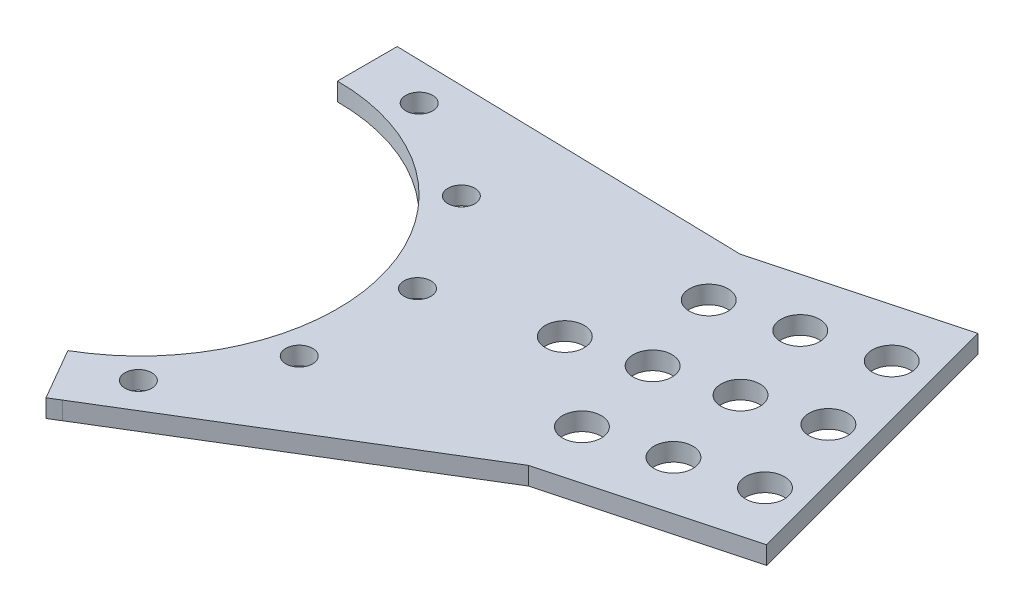
ISO-10303-21;
HEADER;
FILE_DESCRIPTION(('STEP AP214'),'2;1');
FILE_NAME('part.step','',(''),(''),'','','');
FILE_SCHEMA(('AUTOMOTIVE_DESIGN { 1 0 10303 214 1 1 1 1 }'));
ENDSEC;
DATA;
#1=APPLICATION_CONTEXT('core data for automotive mechanical design processes');
#2=APPLICATION_PROTOCOL_DEFINITION('international standard','automotive_design',2000,#1);
#3=PRODUCT_CONTEXT('',#1,'mechanical');
#4=PRODUCT('Part','Part','',(#3));
#5=PRODUCT_RELATED_PRODUCT_CATEGORY('part','',(#4));
#6=PRODUCT_DEFINITION_FORMATION('','',#4);
#7=PRODUCT_DEFINITION_CONTEXT('part definition',#1,'design');
#8=PRODUCT_DEFINITION('design','',#6,#7);
#9=PRODUCT_DEFINITION_SHAPE('','',#8);
#10=(LENGTH_UNIT() NAMED_UNIT(*) SI_UNIT(.MILLI.,.METRE.));
#11=(NAMED_UNIT(*) PLANE_ANGLE_UNIT() SI_UNIT($,.RADIAN.));
#12=(NAMED_UNIT(*) SI_UNIT($,.STERADIAN.) SOLID_ANGLE_UNIT());
#13=UNCERTAINTY_MEASURE_WITH_UNIT(LENGTH_MEASURE(1.E-05),#10,'distance_accuracy_value','');
#14=(GEOMETRIC_REPRESENTATION_CONTEXT(3) GLOBAL_UNCERTAINTY_ASSIGNED_CONTEXT((#13)) GLOBAL_UNIT_ASSIGNED_CONTEXT((#10,
#11,#12)) REPRESENTATION_CONTEXT('',''));
#15=CARTESIAN_POINT('',(0.,0.,0.));
#16=DIRECTION('',(0.,0.,1.));
#17=DIRECTION('',(1.,0.,0.));
#18=AXIS2_PLACEMENT_3D('',#15,#16,#17);
#19=CARTESIAN_POINT('',(56.0236979247659,-8.5,-15.0115046159464));
#20=DIRECTION('',(0.,1.,0.));
#21=DIRECTION('',(0.,0.,1.));
#22=AXIS2_PLACEMENT_3D('',#19,#20,#21);
#23=CYLINDRICAL_SURFACE('',#22,3.25000000000001);
#24=CARTESIAN_POINT('',(56.0236979247659,-1.5,-15.0115046159464));
#25=DIRECTION('',(0.,-1.,0.));
#26=DIRECTION('',(0.,0.,-1.));
#27=AXIS2_PLACEMENT_3D('',#24,#25,#26);
#28=CIRCLE('',#27,3.25000000000001);
#29=CARTESIAN_POINT('',(56.0236979247659,-1.5,-18.2615046159464));
#30=VERTEX_POINT('',#29);
#31=EDGE_CURVE('E39',#30,#30,#28,.T.);
#32=ORIENTED_EDGE('',*,*,#31,.T.);
#33=EDGE_LOOP('',(#32));
#34=FACE_BOUND('',#33,.T.);
#35=CARTESIAN_POINT('',(56.0236979247659,1.5,-15.0115046159464));
#36=DIRECTION('',(0.,1.,0.));
#37=DIRECTION('',(0.,0.,1.));
#38=AXIS2_PLACEMENT_3D('',#35,#36,#37);
#39=CIRCLE('',#38,3.25000000000001);
#40=CARTESIAN_POINT('',(56.0236979247659,1.5,-11.7615046159464));
#41=VERTEX_POINT('',#40);
#42=EDGE_CURVE('E11',#41,#41,#39,.T.);
#43=ORIENTED_EDGE('',*,*,#42,.T.);
#44=EDGE_LOOP('',(#43));
#45=FACE_BOUND('',#44,.T.);
#46=ADVANCED_FACE('F32',(#34,#45),#23,.F.);
#47=CARTESIAN_POINT('',(67.6148078402347,-8.5,-18.1173331571768));
#48=DIRECTION('',(0.,1.,0.));
#49=DIRECTION('',(0.,0.,1.));
#50=AXIS2_PLACEMENT_3D('',#47,#48,#49);
#51=CYLINDRICAL_SURFACE('',#50,3.25000000000001);
#52=CARTESIAN_POINT('',(67.6148078402347,-1.5,-18.1173331571768));
#53=DIRECTION('',(0.,-1.,0.));
#54=DIRECTION('',(0.,0.,-1.));
#55=AXIS2_PLACEMENT_3D('',#52,#53,#54);
#56=CIRCLE('',#55,3.25000000000001);
#57=CARTESIAN_POINT('',(67.6148078402347,-1.5,-21.3673331571768));
#58=VERTEX_POINT('',#57);
#59=EDGE_CURVE('E193',#58,#58,#56,.T.);
#60=ORIENTED_EDGE('',*,*,#59,.T.);
#61=EDGE_LOOP('',(#60));
#62=FACE_BOUND('',#61,.T.);
#63=CARTESIAN_POINT('',(67.6148078402347,1.5,-18.1173331571768));
#64=DIRECTION('',(0.,1.,0.));
#65=DIRECTION('',(0.,0.,1.));
#66=AXIS2_PLACEMENT_3D('',#63,#64,#65);
#67=CIRCLE('',#66,3.25000000000001);
#68=CARTESIAN_POINT('',(67.6148078402347,1.5,-14.8673331571768));
#69=VERTEX_POINT('',#68);
#70=EDGE_CURVE('E201',#69,#69,#67,.T.);
#71=ORIENTED_EDGE('',*,*,#70,.T.);
#72=EDGE_LOOP('',(#71));
#73=FACE_BOUND('',#72,.T.);
#74=ADVANCED_FACE('F228',(#62,#73),#51,.F.);
#75=CARTESIAN_POINT('',(0.,1.5,0.));
#76=DIRECTION('',(0.,-1.,0.));
#77=DIRECTION('',(0.,0.,-1.));
#78=AXIS2_PLACEMENT_3D('',#75,#76,#77);
#79=CYLINDRICAL_SURFACE('',#78,43.);
#80=DIRECTION('',(0.,-1.,0.));
#81=VECTOR('',#80,1.);
#82=CARTESIAN_POINT('',(23.2297705515371,1.5,36.1853252040511));
#83=LINE('',#82,#81);
#84=CARTESIAN_POINT('',(23.2297705515363,1.5,36.1853252040517));
#85=VERTEX_POINT('',#84);
#86=CARTESIAN_POINT('',(23.2297705515363,-1.5,36.1853252040517));
#87=VERTEX_POINT('',#86);
#88=EDGE_CURVE('E46',#85,#87,#83,.T.);
#89=ORIENTED_EDGE('',*,*,#88,.F.);
#90=CARTESIAN_POINT('',(0.,1.5,0.));
#91=DIRECTION('',(0.,1.,0.));
#92=DIRECTION('',(0.,0.,-1.));
#93=AXIS2_PLACEMENT_3D('',#90,#91,#92);
#94=CIRCLE('',#93,43.);
#95=CARTESIAN_POINT('',(21.4999999999998,1.5,37.239092362731));
#96=VERTEX_POINT('',#95);
#97=EDGE_CURVE('E166',#96,#85,#94,.T.);
#98=ORIENTED_EDGE('',*,*,#97,.F.);
#99=DIRECTION('',(0.,-1.,0.));
#100=VECTOR('',#99,1.);
#101=CARTESIAN_POINT('',(21.4999999999998,1.5,37.239092362731));
#102=LINE('',#101,#100);
#103=CARTESIAN_POINT('',(21.4999999999998,-1.5,37.239092362731));
#104=VERTEX_POINT('',#103);
#105=EDGE_CURVE('E175',#96,#104,#102,.T.);
#106=ORIENTED_EDGE('',*,*,#105,.T.);
#107=CARTESIAN_POINT('',(0.,-1.5,0.));
#108=DIRECTION('',(0.,1.,0.));
#109=DIRECTION('',(0.,0.,-1.));
#110=AXIS2_PLACEMENT_3D('',#107,#108,#109);
#111=CIRCLE('',#110,43.);
#112=EDGE_CURVE('E51',#104,#87,#111,.T.);
#113=ORIENTED_EDGE('',*,*,#112,.T.);
#114=EDGE_LOOP('',(#89,#98,#106,#113));
#115=FACE_BOUND('',#114,.T.);
#116=ADVANCED_FACE('F233',(#115),#79,.T.);
#117=CARTESIAN_POINT('',(103.06305875647,1.5,-1.73375885302606));
#118=DIRECTION('',(-0.258819045102531,0.,-0.965925826289066));
#119=DIRECTION('',(-0.965925826289066,0.,0.258819045102531));
#120=AXIS2_PLACEMENT_3D('',#117,#118,#119);
#121=PLANE('',#120);
#122=DIRECTION('',(0.,-1.,0.));
#123=VECTOR('',#122,1.);
#124=CARTESIAN_POINT('',(71.6635685232573,1.5,6.67970919771229));
#125=LINE('',#124,#123);
#126=CARTESIAN_POINT('',(71.6635685232573,1.5,6.67970919771258));
#127=VERTEX_POINT('',#126);
#128=CARTESIAN_POINT('',(71.6635685232573,-1.5,6.67970919771229));
#129=VERTEX_POINT('',#128);
#130=EDGE_CURVE('E123',#127,#129,#125,.T.);
#131=ORIENTED_EDGE('',*,*,#130,.T.);
#132=DIRECTION('',(0.965925826289065,0.,-0.258819045102531));
#133=VECTOR('',#132,1.);
#134=CARTESIAN_POINT('',(103.06305875647,-1.5,-1.73375885302606));
#135=LINE('',#134,#133);
#136=CARTESIAN_POINT('',(103.06305875647,-1.5,-1.73375885302606));
#137=VERTEX_POINT('',#136);
#138=EDGE_CURVE('E108',#129,#137,#135,.T.);
#139=ORIENTED_EDGE('',*,*,#138,.T.);
#140=DIRECTION('',(0.,-1.,0.));
#141=VECTOR('',#140,1.);
#142=CARTESIAN_POINT('',(103.06305875647,1.5,-1.73375885302606));
#143=LINE('',#142,#141);
#144=CARTESIAN_POINT('',(103.06305875647,1.5,-1.73375885302606));
#145=VERTEX_POINT('',#144);
#146=EDGE_CURVE('E158',#145,#137,#143,.T.);
#147=ORIENTED_EDGE('',*,*,#146,.F.);
#148=DIRECTION('',(0.965925826289065,0.,-0.258819045102531));
#149=VECTOR('',#148,1.);
#150=CARTESIAN_POINT('',(103.06305875647,1.5,-1.73375885302606));
#151=LINE('',#150,#149);
#152=EDGE_CURVE('E125',#127,#145,#151,.T.);
#153=ORIENTED_EDGE('',*,*,#152,.F.);
#154=EDGE_LOOP('',(#131,#139,#147,#153));
#155=FACE_BOUND('',#154,.T.);
#156=ADVANCED_FACE('F124',(#155),#121,.F.);
#157=DIRECTION('',(0.,-1.,0.));
#158=VECTOR('',#157,1.);
#159=CARTESIAN_POINT('',(2.02490881968836,1.5,-42.9522961466782));
#160=LINE('',#159,#158);
#161=CARTESIAN_POINT('',(2.02490881968772,-1.5,-42.9522961466782));
#162=VERTEX_POINT('',#161);
#163=CARTESIAN_POINT('',(2.02490881968772,1.5,-42.9522961466782));
#164=VERTEX_POINT('',#163);
#165=EDGE_CURVE('E149',#162,#164,#160,.F.);
#166=ORIENTED_EDGE('',*,*,#165,.F.);
#167=CARTESIAN_POINT('',(0.,-1.5,-43.));
#168=VERTEX_POINT('',#167);
#169=EDGE_CURVE('E165',#162,#168,#111,.T.);
#170=ORIENTED_EDGE('',*,*,#169,.T.);
#171=DIRECTION('',(0.,-1.,0.));
#172=VECTOR('',#171,1.);
#173=CARTESIAN_POINT('',(0.,1.5,-43.));
#174=LINE('',#173,#172);
#175=CARTESIAN_POINT('',(0.,1.5,-43.));
#176=VERTEX_POINT('',#175);
#177=EDGE_CURVE('E190',#176,#168,#174,.T.);
#178=ORIENTED_EDGE('',*,*,#177,.F.);
#179=EDGE_CURVE('E169',#164,#176,#94,.T.);
#180=ORIENTED_EDGE('',*,*,#179,.F.);
#181=EDGE_LOOP('',(#166,#170,#178,#180));
#182=FACE_BOUND('',#181,.T.);
#183=ADVANCED_FACE('F240',(#182),#79,.T.);
#184=CARTESIAN_POINT('',(90.1221065013434,1.5,-50.0300501674793));
#185=DIRECTION('',(0.258819045102531,0.,0.965925826289065));
#186=DIRECTION('',(0.965925826289066,0.,-0.258819045102531));
#187=AXIS2_PLACEMENT_3D('',#184,#185,#186);
#188=PLANE('',#187);
#189=DIRECTION('',(0.,-1.,0.));
#190=VECTOR('',#189,1.);
#191=CARTESIAN_POINT('',(58.722616268131,1.5,-41.6165821167408));
#192=LINE('',#191,#190);
#193=CARTESIAN_POINT('',(58.722616268131,1.5,-41.6165821167408));
#194=VERTEX_POINT('',#193);
#195=CARTESIAN_POINT('',(58.722616268131,-1.5,-41.6165821167408));
#196=VERTEX_POINT('',#195);
#197=EDGE_CURVE('E144',#194,#196,#192,.T.);
#198=ORIENTED_EDGE('',*,*,#197,.F.);
#199=DIRECTION('',(-0.965925826289066,0.,0.258819045102531));
#200=VECTOR('',#199,1.);
#201=CARTESIAN_POINT('',(90.1221065013434,1.5,-50.0300501674793));
#202=LINE('',#201,#200);
#203=CARTESIAN_POINT('',(90.1221065013434,1.5,-50.0300501674793));
#204=VERTEX_POINT('',#203);
#205=EDGE_CURVE('E154',#204,#194,#202,.T.);
#206=ORIENTED_EDGE('',*,*,#205,.F.);
#207=DIRECTION('',(0.,-1.,0.));
#208=VECTOR('',#207,1.);
#209=CARTESIAN_POINT('',(90.1221065013434,1.5,-50.0300501674793));
#210=LINE('',#209,#208);
#211=CARTESIAN_POINT('',(90.1221065013434,-1.5,-50.0300501674793));
#212=VERTEX_POINT('',#211);
#213=EDGE_CURVE('E162',#204,#212,#210,.T.);
#214=ORIENTED_EDGE('',*,*,#213,.T.);
#215=DIRECTION('',(-0.965925826289066,0.,0.258819045102531));
#216=VECTOR('',#215,1.);
#217=CARTESIAN_POINT('',(90.1221065013434,-1.5,-50.0300501674793));
#218=LINE('',#217,#216);
#219=EDGE_CURVE('E120',#212,#196,#218,.T.);
#220=ORIENTED_EDGE('',*,*,#219,.T.);
#221=EDGE_LOOP('',(#198,#206,#214,#220));
#222=FACE_BOUND('',#221,.T.);
#223=ADVANCED_FACE('F244',(#222),#188,.F.);
#224=CARTESIAN_POINT('',(0.,1.5,-33.));
#225=DIRECTION('',(1.,0.,0.));
#226=DIRECTION('',(0.,0.,-1.));
#227=AXIS2_PLACEMENT_3D('',#224,#225,#226);
#228=PLANE('',#227);
#229=DIRECTION('',(0.,0.,1.));
#230=VECTOR('',#229,1.);
#231=CARTESIAN_POINT('',(0.,-1.5,-33.));
#232=LINE('',#231,#230);
#233=CARTESIAN_POINT('',(0.,-1.5,-33.));
#234=VERTEX_POINT('',#233);
#235=EDGE_CURVE('E177',#168,#234,#232,.T.);
#236=ORIENTED_EDGE('',*,*,#235,.T.);
#237=DIRECTION('',(0.,-1.,0.));
#238=VECTOR('',#237,1.);
#239=CARTESIAN_POINT('',(0.,1.5,-33.));
#240=LINE('',#239,#238);
#241=CARTESIAN_POINT('',(0.,1.5,-33.));
#242=VERTEX_POINT('',#241);
#243=EDGE_CURVE('E187',#242,#234,#240,.T.);
#244=ORIENTED_EDGE('',*,*,#243,.F.);
#245=DIRECTION('',(0.,0.,1.));
#246=VECTOR('',#245,1.);
#247=CARTESIAN_POINT('',(0.,1.5,-33.));
#248=LINE('',#247,#246);
#249=EDGE_CURVE('E168',#176,#242,#248,.T.);
#250=ORIENTED_EDGE('',*,*,#249,.F.);
#251=ORIENTED_EDGE('',*,*,#177,.T.);
#252=EDGE_LOOP('',(#236,#244,#250,#251));
#253=FACE_BOUND('',#252,.T.);
#254=ADVANCED_FACE('F246',(#253),#228,.F.);
#255=CARTESIAN_POINT('',(0.,1.5,0.));
#256=DIRECTION('',(0.,-1.,0.));
#257=DIRECTION('',(0.,0.,-1.));
#258=AXIS2_PLACEMENT_3D('',#255,#256,#257);
#259=CYLINDRICAL_SURFACE('',#258,33.);
#260=CARTESIAN_POINT('',(0.,-1.5,0.));
#261=DIRECTION('',(0.,-1.,0.));
#262=DIRECTION('',(0.,0.,-1.));
#263=AXIS2_PLACEMENT_3D('',#260,#261,#262);
#264=CIRCLE('',#263,33.);
#265=CARTESIAN_POINT('',(16.4999999999998,-1.5,28.5788383248866));
#266=VERTEX_POINT('',#265);
#267=EDGE_CURVE('E179',#234,#266,#264,.T.);
#268=ORIENTED_EDGE('',*,*,#267,.T.);
#269=DIRECTION('',(0.,-1.,0.));
#270=VECTOR('',#269,1.);
#271=CARTESIAN_POINT('',(16.4999999999998,1.5,28.5788383248866));
#272=LINE('',#271,#270);
#273=CARTESIAN_POINT('',(16.4999999999998,1.5,28.5788383248866));
#274=VERTEX_POINT('',#273);
#275=EDGE_CURVE('E184',#274,#266,#272,.T.);
#276=ORIENTED_EDGE('',*,*,#275,.F.);
#277=CARTESIAN_POINT('',(0.,1.5,0.));
#278=DIRECTION('',(0.,-1.,0.));
#279=DIRECTION('',(0.,0.,-1.));
#280=AXIS2_PLACEMENT_3D('',#277,#278,#279);
#281=CIRCLE('',#280,33.);
#282=EDGE_CURVE('E171',#242,#274,#281,.T.);
#283=ORIENTED_EDGE('',*,*,#282,.F.);
#284=ORIENTED_EDGE('',*,*,#243,.T.);
#285=EDGE_LOOP('',(#268,#276,#283,#284));
#286=FACE_BOUND('',#285,.T.);
#287=ADVANCED_FACE('F249',(#286),#259,.F.);
#288=CARTESIAN_POINT('',(16.4999999999998,1.5,28.5788383248866));
#289=DIRECTION('',(0.866025403784441,0.,-0.499999999999995));
#290=DIRECTION('',(-0.499999999999995,0.,-0.866025403784441));
#291=AXIS2_PLACEMENT_3D('',#288,#289,#290);
#292=PLANE('',#291);
#293=DIRECTION('',(0.499999999999995,0.,0.866025403784441));
#294=VECTOR('',#293,1.);
#295=CARTESIAN_POINT('',(16.4999999999998,-1.5,28.5788383248866));
#296=LINE('',#295,#294);
#297=EDGE_CURVE('E181',#266,#104,#296,.T.);
#298=ORIENTED_EDGE('',*,*,#297,.T.);
#299=ORIENTED_EDGE('',*,*,#105,.F.);
#300=DIRECTION('',(0.499999999999995,0.,0.866025403784441));
#301=VECTOR('',#300,1.);
#302=CARTESIAN_POINT('',(16.4999999999998,1.5,28.5788383248866));
#303=LINE('',#302,#301);
#304=EDGE_CURVE('E173',#274,#96,#303,.T.);
#305=ORIENTED_EDGE('',*,*,#304,.F.);
#306=ORIENTED_EDGE('',*,*,#275,.T.);
#307=EDGE_LOOP('',(#298,#299,#305,#306));
#308=FACE_BOUND('',#307,.T.);
#309=ADVANCED_FACE('F221',(#308),#292,.F.);
#310=CARTESIAN_POINT('',(0.,1.5,0.));
#311=DIRECTION('',(0.,-1.,0.));
#312=DIRECTION('',(0.,0.,-1.));
#313=AXIS2_PLACEMENT_3D('',#310,#311,#312);
#314=PLANE('',#313);
#315=CARTESIAN_POINT('',(79.2059177557035,1.5,-21.2231616984072));
#316=DIRECTION('',(0.,1.,0.));
#317=DIRECTION('',(0.,0.,1.));
#318=AXIS2_PLACEMENT_3D('',#315,#316,#317);
#319=CIRCLE('',#318,3.25000000000001);
#320=CARTESIAN_POINT('',(79.2059177557035,1.5,-17.9731616984071));
#321=VERTEX_POINT('',#320);
#322=EDGE_CURVE('E343',#321,#321,#319,.T.);
#323=ORIENTED_EDGE('',*,*,#322,.F.);
#324=EDGE_LOOP('',(#323));
#325=FACE_BOUND('',#324,.T.);
#326=CARTESIAN_POINT('',(90.7970276711723,1.5,-24.3289902396375));
#327=DIRECTION('',(0.,1.,0.));
#328=DIRECTION('',(0.,0.,1.));
#329=AXIS2_PLACEMENT_3D('',#326,#327,#328);
#330=CIRCLE('',#329,3.25000000000001);
#331=CARTESIAN_POINT('',(90.7970276711723,1.5,-21.0789902396375));
#332=VERTEX_POINT('',#331);
#333=EDGE_CURVE('E198',#332,#332,#330,.T.);
#334=ORIENTED_EDGE('',*,*,#333,.F.);
#335=EDGE_LOOP('',(#334));
#336=FACE_BOUND('',#335,.T.);
#337=CARTESIAN_POINT('',(82.6052405190969,1.5,-6.60486478151987));
#338=DIRECTION('',(0.,-1.,0.));
#339=DIRECTION('',(0.,0.,-1.));
#340=AXIS2_PLACEMENT_3D('',#337,#338,#339);
#341=CIRCLE('',#340,3.25000000000001);
#342=CARTESIAN_POINT('',(82.6052405190969,1.5,-9.85486478151988));
#343=VERTEX_POINT('',#342);
#344=EDGE_CURVE('E369',#343,#343,#341,.T.);
#345=ORIENTED_EDGE('',*,*,#344,.T.);
#346=EDGE_LOOP('',(#345));
#347=FACE_BOUND('',#346,.T.);
#348=CARTESIAN_POINT('',(74.840669166021,1.5,-35.5826395701919));
#349=DIRECTION('',(0.,-1.,0.));
#350=DIRECTION('',(0.,0.,-1.));
#351=AXIS2_PLACEMENT_3D('',#348,#349,#350);
#352=CIRCLE('',#351,3.25000000000001);
#353=CARTESIAN_POINT('',(74.840669166021,1.5,-38.8326395701919));
#354=VERTEX_POINT('',#353);
#355=EDGE_CURVE('E366',#354,#354,#352,.T.);
#356=ORIENTED_EDGE('',*,*,#355,.T.);
#357=EDGE_LOOP('',(#356));
#358=FACE_BOUND('',#357,.T.);
#359=CARTESIAN_POINT('',(70.5311676904836,1.5,-3.36962671773823));
#360=DIRECTION('',(0.,-1.,0.));
#361=DIRECTION('',(0.,0.,-1.));
#362=AXIS2_PLACEMENT_3D('',#359,#360,#361);
#363=CIRCLE('',#362,3.25000000000001);
#364=CARTESIAN_POINT('',(70.5311676904836,1.5,-6.61962671773824));
#365=VERTEX_POINT('',#364);
#366=EDGE_CURVE('E363',#365,#365,#363,.T.);
#367=ORIENTED_EDGE('',*,*,#366,.T.);
#368=EDGE_LOOP('',(#367));
#369=FACE_BOUND('',#368,.T.);
#370=CARTESIAN_POINT('',(62.7665963374077,1.5,-32.3474015064102));
#371=DIRECTION('',(0.,-1.,0.));
#372=DIRECTION('',(0.,0.,-1.));
#373=AXIS2_PLACEMENT_3D('',#370,#371,#372);
#374=CIRCLE('',#373,3.25000000000001);
#375=CARTESIAN_POINT('',(62.7665963374077,1.5,-35.5974015064102));
#376=VERTEX_POINT('',#375);
#377=EDGE_CURVE('E352',#376,#376,#374,.T.);
#378=ORIENTED_EDGE('',*,*,#377,.T.);
#379=EDGE_LOOP('',(#378));
#380=FACE_BOUND('',#379,.T.);
#381=CARTESIAN_POINT('',(94.6793133477102,1.5,-9.84010284530152));
#382=DIRECTION('',(0.,-1.,0.));
#383=DIRECTION('',(0.,0.,-1.));
#384=AXIS2_PLACEMENT_3D('',#381,#382,#383);
#385=CIRCLE('',#384,3.25000000000001);
#386=CARTESIAN_POINT('',(94.6793133477102,1.5,-13.0901028453015));
#387=VERTEX_POINT('',#386);
#388=EDGE_CURVE('E381',#387,#387,#385,.T.);
#389=ORIENTED_EDGE('',*,*,#388,.T.);
#390=EDGE_LOOP('',(#389));
#391=FACE_BOUND('',#390,.T.);
#392=CARTESIAN_POINT('',(86.9147419946343,1.5,-38.8178776339735));
#393=DIRECTION('',(0.,-1.,0.));
#394=DIRECTION('',(0.,0.,-1.));
#395=AXIS2_PLACEMENT_3D('',#392,#393,#394);
#396=CIRCLE('',#395,3.25000000000001);
#397=CARTESIAN_POINT('',(86.9147419946343,1.5,-42.0678776339735));
#398=VERTEX_POINT('',#397);
#399=EDGE_CURVE('E376',#398,#398,#396,.T.);
#400=ORIENTED_EDGE('',*,*,#399,.T.);
#401=EDGE_LOOP('',(#400));
#402=FACE_BOUND('',#401,.T.);
#403=CARTESIAN_POINT('',(36.6520508829246,1.5,10.0313092901925));
#404=DIRECTION('',(0.,-1.,0.));
#405=DIRECTION('',(0.,0.,-1.));
#406=AXIS2_PLACEMENT_3D('',#403,#404,#405);
#407=CIRCLE('',#406,2.25);
#408=CARTESIAN_POINT('',(36.6520508829246,1.5,7.78130929019255));
#409=VERTEX_POINT('',#408);
#410=EDGE_CURVE('E405',#409,#409,#407,.T.);
#411=ORIENTED_EDGE('',*,*,#410,.T.);
#412=EDGE_LOOP('',(#411));
#413=FACE_BOUND('',#412,.T.);
#414=CARTESIAN_POINT('',(26.7259525203163,1.5,27.0133941199879));
#415=DIRECTION('',(0.,-1.,0.));
#416=DIRECTION('',(0.,0.,-1.));
#417=AXIS2_PLACEMENT_3D('',#414,#415,#416);
#418=CIRCLE('',#417,2.25);
#419=CARTESIAN_POINT('',(26.7259525203163,1.5,24.7633941199879));
#420=VERTEX_POINT('',#419);
#421=EDGE_CURVE('E402',#420,#420,#418,.T.);
#422=ORIENTED_EDGE('',*,*,#421,.T.);
#423=EDGE_LOOP('',(#422));
#424=FACE_BOUND('',#423,.T.);
#425=CARTESIAN_POINT('',(27.0133941199878,1.5,-26.7259525203164));
#426=DIRECTION('',(0.,-1.,0.));
#427=DIRECTION('',(0.,0.,-1.));
#428=AXIS2_PLACEMENT_3D('',#425,#426,#427);
#429=CIRCLE('',#428,2.25);
#430=CARTESIAN_POINT('',(27.0133941199878,1.5,-28.9759525203164));
#431=VERTEX_POINT('',#430);
#432=EDGE_CURVE('E399',#431,#431,#429,.T.);
#433=ORIENTED_EDGE('',*,*,#432,.T.);
#434=EDGE_LOOP('',(#433));
#435=FACE_BOUND('',#434,.T.);
#436=CARTESIAN_POINT('',(10.0313092901924,1.5,-36.6520508829247));
#437=DIRECTION('',(0.,-1.,0.));
#438=DIRECTION('',(0.,0.,-1.));
#439=AXIS2_PLACEMENT_3D('',#436,#437,#438);
#440=CIRCLE('',#439,2.25);
#441=CARTESIAN_POINT('',(10.0313092901924,1.5,-38.9020508829247));
#442=VERTEX_POINT('',#441);
#443=EDGE_CURVE('E388',#442,#442,#440,.T.);
#444=ORIENTED_EDGE('',*,*,#443,.T.);
#445=EDGE_LOOP('',(#444));
#446=FACE_BOUND('',#445,.T.);
#447=CARTESIAN_POINT('',(36.7572618105089,1.5,-9.63865676293677));
#448=DIRECTION('',(0.,-1.,0.));
#449=DIRECTION('',(0.,0.,-1.));
#450=AXIS2_PLACEMENT_3D('',#447,#448,#449);
#451=CIRCLE('',#450,2.25);
#452=CARTESIAN_POINT('',(36.7572618105089,1.5,-11.8886567629368));
#453=VERTEX_POINT('',#452);
#454=EDGE_CURVE('E132',#453,#453,#451,.T.);
#455=ORIENTED_EDGE('',*,*,#454,.T.);
#456=EDGE_LOOP('',(#455));
#457=FACE_BOUND('',#456,.T.);
#458=ORIENTED_EDGE('',*,*,#97,.T.);
#459=DIRECTION('',(0.854009187870222,0.,-0.520257923566037));
#460=VECTOR('',#459,1.);
#461=CARTESIAN_POINT('',(21.5000000000005,1.5,37.2390923627306));
#462=LINE('',#461,#460);
#463=EDGE_CURVE('E129',#85,#127,#462,.T.);
#464=ORIENTED_EDGE('',*,*,#463,.T.);
#465=ORIENTED_EDGE('',*,*,#152,.T.);
#466=DIRECTION('',(-0.258819045102531,0.,-0.965925826289066));
#467=VECTOR('',#466,1.);
#468=CARTESIAN_POINT('',(90.1221065013434,1.5,-50.0300501674793));
#469=LINE('',#468,#467);
#470=EDGE_CURVE('E119',#145,#204,#469,.T.);
#471=ORIENTED_EDGE('',*,*,#470,.T.);
#472=ORIENTED_EDGE('',*,*,#205,.T.);
#473=DIRECTION('',(-0.999722613543948,0.,-0.0235519843932077));
#474=VECTOR('',#473,1.);
#475=CARTESIAN_POINT('',(0.,1.5,-43.));
#476=LINE('',#475,#474);
#477=EDGE_CURVE('E141',#194,#164,#476,.T.);
#478=ORIENTED_EDGE('',*,*,#477,.T.);
#479=ORIENTED_EDGE('',*,*,#179,.T.);
#480=ORIENTED_EDGE('',*,*,#249,.T.);
#481=ORIENTED_EDGE('',*,*,#282,.T.);
#482=ORIENTED_EDGE('',*,*,#304,.T.);
#483=EDGE_LOOP('',(#458,#464,#465,#471,#472,#478,#479,#480,#481,#482));
#484=FACE_BOUND('',#483,.T.);
#485=ORIENTED_EDGE('',*,*,#70,.F.);
#486=EDGE_LOOP('',(#485));
#487=FACE_BOUND('',#486,.T.);
#488=ORIENTED_EDGE('',*,*,#42,.F.);
#489=EDGE_LOOP('',(#488));
#490=FACE_BOUND('',#489,.T.);
#491=ADVANCED_FACE('F210',(#325,#336,#347,#358,#369,#380,#391,#402,#413,#424,#435,#446,#457,
#484,#487,#490),#314,.F.);
#492=CARTESIAN_POINT('',(0.,-1.5,0.));
#493=DIRECTION('',(0.,-1.,0.));
#494=DIRECTION('',(0.,0.,-1.));
#495=AXIS2_PLACEMENT_3D('',#492,#493,#494);
#496=PLANE('',#495);
#497=CARTESIAN_POINT('',(79.2059177557035,-1.5,-21.2231616984072));
#498=DIRECTION('',(0.,-1.,0.));
#499=DIRECTION('',(0.,0.,-1.));
#500=AXIS2_PLACEMENT_3D('',#497,#498,#499);
#501=CIRCLE('',#500,3.25000000000001);
#502=CARTESIAN_POINT('',(79.2059177557035,-1.5,-24.4731616984072));
#503=VERTEX_POINT('',#502);
#504=EDGE_CURVE('E340',#503,#503,#501,.T.);
#505=ORIENTED_EDGE('',*,*,#504,.F.);
#506=EDGE_LOOP('',(#505));
#507=FACE_BOUND('',#506,.T.);
#508=CARTESIAN_POINT('',(90.7970276711723,-1.5,-24.3289902396375));
#509=DIRECTION('',(0.,-1.,0.));
#510=DIRECTION('',(0.,0.,-1.));
#511=AXIS2_PLACEMENT_3D('',#508,#509,#510);
#512=CIRCLE('',#511,3.25000000000001);
#513=CARTESIAN_POINT('',(90.7970276711723,-1.5,-27.5789902396375));
#514=VERTEX_POINT('',#513);
#515=EDGE_CURVE('E194',#514,#514,#512,.T.);
#516=ORIENTED_EDGE('',*,*,#515,.F.);
#517=EDGE_LOOP('',(#516));
#518=FACE_BOUND('',#517,.T.);
#519=CARTESIAN_POINT('',(82.6052405190969,-1.5,-6.60486478151987));
#520=DIRECTION('',(0.,1.,0.));
#521=DIRECTION('',(0.,0.,1.));
#522=AXIS2_PLACEMENT_3D('',#519,#520,#521);
#523=CIRCLE('',#522,3.25000000000001);
#524=CARTESIAN_POINT('',(82.6052405190969,-1.5,-3.35486478151987));
#525=VERTEX_POINT('',#524);
#526=EDGE_CURVE('E349',#525,#525,#523,.T.);
#527=ORIENTED_EDGE('',*,*,#526,.T.);
#528=EDGE_LOOP('',(#527));
#529=FACE_BOUND('',#528,.T.);
#530=CARTESIAN_POINT('',(74.840669166021,-1.5,-35.5826395701919));
#531=DIRECTION('',(0.,1.,0.));
#532=DIRECTION('',(0.,0.,1.));
#533=AXIS2_PLACEMENT_3D('',#530,#531,#532);
#534=CIRCLE('',#533,3.25000000000001);
#535=CARTESIAN_POINT('',(74.840669166021,-1.5,-32.3326395701918));
#536=VERTEX_POINT('',#535);
#537=EDGE_CURVE('E353',#536,#536,#534,.T.);
#538=ORIENTED_EDGE('',*,*,#537,.T.);
#539=EDGE_LOOP('',(#538));
#540=FACE_BOUND('',#539,.T.);
#541=CARTESIAN_POINT('',(70.5311676904836,-1.5,-3.36962671773823));
#542=DIRECTION('',(0.,1.,0.));
#543=DIRECTION('',(0.,0.,1.));
#544=AXIS2_PLACEMENT_3D('',#541,#542,#543);
#545=CIRCLE('',#544,3.25000000000001);
#546=CARTESIAN_POINT('',(70.5311676904836,-1.5,-0.119626717738223));
#547=VERTEX_POINT('',#546);
#548=EDGE_CURVE('E356',#547,#547,#545,.T.);
#549=ORIENTED_EDGE('',*,*,#548,.T.);
#550=EDGE_LOOP('',(#549));
#551=FACE_BOUND('',#550,.T.);
#552=CARTESIAN_POINT('',(62.7665963374077,-1.5,-32.3474015064102));
#553=DIRECTION('',(0.,1.,0.));
#554=DIRECTION('',(0.,0.,1.));
#555=AXIS2_PLACEMENT_3D('',#552,#553,#554);
#556=CIRCLE('',#555,3.25000000000001);
#557=CARTESIAN_POINT('',(62.7665963374077,-1.5,-29.0974015064102));
#558=VERTEX_POINT('',#557);
#559=EDGE_CURVE('E197',#558,#558,#556,.T.);
#560=ORIENTED_EDGE('',*,*,#559,.T.);
#561=EDGE_LOOP('',(#560));
#562=FACE_BOUND('',#561,.T.);
#563=CARTESIAN_POINT('',(94.6793133477102,-1.5,-9.84010284530152));
#564=DIRECTION('',(0.,1.,0.));
#565=DIRECTION('',(0.,0.,1.));
#566=AXIS2_PLACEMENT_3D('',#563,#564,#565);
#567=CIRCLE('',#566,3.25000000000001);
#568=CARTESIAN_POINT('',(94.6793133477102,-1.5,-6.59010284530151));
#569=VERTEX_POINT('',#568);
#570=EDGE_CURVE('E373',#569,#569,#567,.T.);
#571=ORIENTED_EDGE('',*,*,#570,.T.);
#572=EDGE_LOOP('',(#571));
#573=FACE_BOUND('',#572,.T.);
#574=CARTESIAN_POINT('',(86.9147419946343,-1.5,-38.8178776339735));
#575=DIRECTION('',(0.,1.,0.));
#576=DIRECTION('',(0.,0.,1.));
#577=AXIS2_PLACEMENT_3D('',#574,#575,#576);
#578=CIRCLE('',#577,3.25000000000001);
#579=CARTESIAN_POINT('',(86.9147419946343,-1.5,-35.5678776339735));
#580=VERTEX_POINT('',#579);
#581=EDGE_CURVE('E372',#580,#580,#578,.T.);
#582=ORIENTED_EDGE('',*,*,#581,.T.);
#583=EDGE_LOOP('',(#582));
#584=FACE_BOUND('',#583,.T.);
#585=CARTESIAN_POINT('',(36.6520508829246,-1.5,10.0313092901925));
#586=DIRECTION('',(0.,1.,0.));
#587=DIRECTION('',(-0.500000000000001,0.,0.866025403784438));
#588=AXIS2_PLACEMENT_3D('',#585,#586,#587);
#589=CIRCLE('',#588,2.25);
#590=CARTESIAN_POINT('',(35.5270508829246,-1.5,11.9798664487075));
#591=VERTEX_POINT('',#590);
#592=EDGE_CURVE('E385',#591,#591,#589,.T.);
#593=ORIENTED_EDGE('',*,*,#592,.T.);
#594=EDGE_LOOP('',(#593));
#595=FACE_BOUND('',#594,.T.);
#596=CARTESIAN_POINT('',(26.7259525203163,-1.5,27.0133941199879));
#597=DIRECTION('',(0.,1.,0.));
#598=DIRECTION('',(-0.86602540378444,0.,0.499999999999998));
#599=AXIS2_PLACEMENT_3D('',#596,#597,#598);
#600=CIRCLE('',#599,2.25);
#601=CARTESIAN_POINT('',(24.7773953618013,-1.5,28.1383941199879));
#602=VERTEX_POINT('',#601);
#603=EDGE_CURVE('E389',#602,#602,#600,.T.);
#604=ORIENTED_EDGE('',*,*,#603,.T.);
#605=EDGE_LOOP('',(#604));
#606=FACE_BOUND('',#605,.T.);
#607=CARTESIAN_POINT('',(27.0133941199878,-1.5,-26.7259525203164));
#608=DIRECTION('',(0.,1.,0.));
#609=DIRECTION('',(0.500000000000001,0.,0.866025403784438));
#610=AXIS2_PLACEMENT_3D('',#607,#608,#609);
#611=CIRCLE('',#610,2.25);
#612=CARTESIAN_POINT('',(28.1383941199878,-1.5,-24.7773953618014));
#613=VERTEX_POINT('',#612);
#614=EDGE_CURVE('E392',#613,#613,#611,.T.);
#615=ORIENTED_EDGE('',*,*,#614,.T.);
#616=EDGE_LOOP('',(#615));
#617=FACE_BOUND('',#616,.T.);
#618=CARTESIAN_POINT('',(10.0313092901924,-1.5,-36.6520508829247));
#619=DIRECTION('',(0.,1.,0.));
#620=DIRECTION('',(0.86602540378444,0.,0.499999999999998));
#621=AXIS2_PLACEMENT_3D('',#618,#619,#620);
#622=CIRCLE('',#621,2.25);
#623=CARTESIAN_POINT('',(11.9798664487074,-1.5,-35.5270508829247));
#624=VERTEX_POINT('',#623);
#625=EDGE_CURVE('E384',#624,#624,#622,.T.);
#626=ORIENTED_EDGE('',*,*,#625,.T.);
#627=EDGE_LOOP('',(#626));
#628=FACE_BOUND('',#627,.T.);
#629=CARTESIAN_POINT('',(36.7572618105089,-1.5,-9.63865676293677));
#630=DIRECTION('',(0.,1.,0.));
#631=DIRECTION('',(0.,0.,1.));
#632=AXIS2_PLACEMENT_3D('',#629,#630,#631);
#633=CIRCLE('',#632,2.25);
#634=CARTESIAN_POINT('',(36.7572618105089,-1.5,-7.38865676293677));
#635=VERTEX_POINT('',#634);
#636=EDGE_CURVE('E136',#635,#635,#633,.T.);
#637=ORIENTED_EDGE('',*,*,#636,.T.);
#638=EDGE_LOOP('',(#637));
#639=FACE_BOUND('',#638,.T.);
#640=DIRECTION('',(0.854009187870222,0.,-0.520257923566037));
#641=VECTOR('',#640,1.);
#642=CARTESIAN_POINT('',(21.5000000000005,-1.5,37.2390923627306));
#643=LINE('',#642,#641);
#644=EDGE_CURVE('E113',#87,#129,#643,.T.);
#645=ORIENTED_EDGE('',*,*,#644,.F.);
#646=ORIENTED_EDGE('',*,*,#112,.F.);
#647=ORIENTED_EDGE('',*,*,#297,.F.);
#648=ORIENTED_EDGE('',*,*,#267,.F.);
#649=ORIENTED_EDGE('',*,*,#235,.F.);
#650=ORIENTED_EDGE('',*,*,#169,.F.);
#651=DIRECTION('',(-0.999722613543948,0.,-0.0235519843932077));
#652=VECTOR('',#651,1.);
#653=CARTESIAN_POINT('',(0.,-1.5,-43.));
#654=LINE('',#653,#652);
#655=EDGE_CURVE('E140',#196,#162,#654,.T.);
#656=ORIENTED_EDGE('',*,*,#655,.F.);
#657=ORIENTED_EDGE('',*,*,#219,.F.);
#658=DIRECTION('',(-0.258819045102531,0.,-0.965925826289066));
#659=VECTOR('',#658,1.);
#660=CARTESIAN_POINT('',(90.1221065013434,-1.5,-50.0300501674793));
#661=LINE('',#660,#659);
#662=EDGE_CURVE('E115',#137,#212,#661,.T.);
#663=ORIENTED_EDGE('',*,*,#662,.F.);
#664=ORIENTED_EDGE('',*,*,#138,.F.);
#665=EDGE_LOOP('',(#645,#646,#647,#648,#649,#650,#656,#657,#663,#664));
#666=FACE_BOUND('',#665,.T.);
#667=ORIENTED_EDGE('',*,*,#59,.F.);
#668=EDGE_LOOP('',(#667));
#669=FACE_BOUND('',#668,.T.);
#670=ORIENTED_EDGE('',*,*,#31,.F.);
#671=EDGE_LOOP('',(#670));
#672=FACE_BOUND('',#671,.T.);
#673=ADVANCED_FACE('F110',(#507,#518,#529,#540,#551,#562,#573,#584,#595,#606,#617,#628,#639,
#666,#669,#672),#496,.T.);
#674=CARTESIAN_POINT('',(90.1221065013434,1.5,-50.0300501674793));
#675=DIRECTION('',(-0.965925826289065,0.,0.258819045102531));
#676=DIRECTION('',(0.258819045102531,0.,0.965925826289066));
#677=AXIS2_PLACEMENT_3D('',#674,#675,#676);
#678=PLANE('',#677);
#679=ORIENTED_EDGE('',*,*,#662,.T.);
#680=ORIENTED_EDGE('',*,*,#213,.F.);
#681=ORIENTED_EDGE('',*,*,#470,.F.);
#682=ORIENTED_EDGE('',*,*,#146,.T.);
#683=EDGE_LOOP('',(#679,#680,#681,#682));
#684=FACE_BOUND('',#683,.T.);
#685=ADVANCED_FACE('F209',(#684),#678,.F.);
#686=CARTESIAN_POINT('',(0.,1.5,-43.));
#687=DIRECTION('',(-0.0235519843932077,0.,0.999722613543948));
#688=DIRECTION('',(0.999722613543948,0.,0.0235519843932077));
#689=AXIS2_PLACEMENT_3D('',#686,#687,#688);
#690=PLANE('',#689);
#691=ORIENTED_EDGE('',*,*,#655,.T.);
#692=ORIENTED_EDGE('',*,*,#165,.T.);
#693=ORIENTED_EDGE('',*,*,#477,.F.);
#694=ORIENTED_EDGE('',*,*,#197,.T.);
#695=EDGE_LOOP('',(#691,#692,#693,#694));
#696=FACE_BOUND('',#695,.T.);
#697=ADVANCED_FACE('F218',(#696),#690,.F.);
#698=CARTESIAN_POINT('',(21.5000000000005,1.5,37.2390923627306));
#699=DIRECTION('',(-0.520257923566037,0.,-0.854009187870221));
#700=DIRECTION('',(-0.854009187870222,0.,0.520257923566037));
#701=AXIS2_PLACEMENT_3D('',#698,#699,#700);
#702=PLANE('',#701);
#703=ORIENTED_EDGE('',*,*,#463,.F.);
#704=ORIENTED_EDGE('',*,*,#88,.T.);
#705=ORIENTED_EDGE('',*,*,#644,.T.);
#706=ORIENTED_EDGE('',*,*,#130,.F.);
#707=EDGE_LOOP('',(#703,#704,#705,#706));
#708=FACE_BOUND('',#707,.T.);
#709=ADVANCED_FACE('F131',(#708),#702,.F.);
#710=CARTESIAN_POINT('',(36.7572618105089,-1.5,-9.63865676293677));
#711=DIRECTION('',(0.,1.,0.));
#712=DIRECTION('',(0.,0.,1.));
#713=AXIS2_PLACEMENT_3D('',#710,#711,#712);
#714=CYLINDRICAL_SURFACE('',#713,2.25);
#715=ORIENTED_EDGE('',*,*,#636,.F.);
#716=EDGE_LOOP('',(#715));
#717=FACE_BOUND('',#716,.T.);
#718=ORIENTED_EDGE('',*,*,#454,.F.);
#719=EDGE_LOOP('',(#718));
#720=FACE_BOUND('',#719,.T.);
#721=ADVANCED_FACE('F288',(#717,#720),#714,.F.);
#722=CARTESIAN_POINT('',(10.0313092901924,-1.5,-36.6520508829247));
#723=DIRECTION('',(0.,1.,0.));
#724=DIRECTION('',(0.,0.,1.));
#725=AXIS2_PLACEMENT_3D('',#722,#723,#724);
#726=CYLINDRICAL_SURFACE('',#725,2.25);
#727=ORIENTED_EDGE('',*,*,#625,.F.);
#728=EDGE_LOOP('',(#727));
#729=FACE_BOUND('',#728,.T.);
#730=ORIENTED_EDGE('',*,*,#443,.F.);
#731=EDGE_LOOP('',(#730));
#732=FACE_BOUND('',#731,.T.);
#733=ADVANCED_FACE('F291',(#729,#732),#726,.F.);
#734=CARTESIAN_POINT('',(27.0133941199878,-1.5,-26.7259525203164));
#735=DIRECTION('',(0.,1.,0.));
#736=DIRECTION('',(0.,0.,1.));
#737=AXIS2_PLACEMENT_3D('',#734,#735,#736);
#738=CYLINDRICAL_SURFACE('',#737,2.25);
#739=ORIENTED_EDGE('',*,*,#614,.F.);
#740=EDGE_LOOP('',(#739));
#741=FACE_BOUND('',#740,.T.);
#742=ORIENTED_EDGE('',*,*,#432,.F.);
#743=EDGE_LOOP('',(#742));
#744=FACE_BOUND('',#743,.T.);
#745=ADVANCED_FACE('F295',(#741,#744),#738,.F.);
#746=CARTESIAN_POINT('',(26.7259525203163,-1.5,27.0133941199879));
#747=DIRECTION('',(0.,1.,0.));
#748=DIRECTION('',(0.,0.,1.));
#749=AXIS2_PLACEMENT_3D('',#746,#747,#748);
#750=CYLINDRICAL_SURFACE('',#749,2.25);
#751=ORIENTED_EDGE('',*,*,#603,.F.);
#752=EDGE_LOOP('',(#751));
#753=FACE_BOUND('',#752,.T.);
#754=ORIENTED_EDGE('',*,*,#421,.F.);
#755=EDGE_LOOP('',(#754));
#756=FACE_BOUND('',#755,.T.);
#757=ADVANCED_FACE('F299',(#753,#756),#750,.F.);
#758=CARTESIAN_POINT('',(36.6520508829246,-1.5,10.0313092901925));
#759=DIRECTION('',(0.,1.,0.));
#760=DIRECTION('',(0.,0.,1.));
#761=AXIS2_PLACEMENT_3D('',#758,#759,#760);
#762=CYLINDRICAL_SURFACE('',#761,2.25);
#763=ORIENTED_EDGE('',*,*,#592,.F.);
#764=EDGE_LOOP('',(#763));
#765=FACE_BOUND('',#764,.T.);
#766=ORIENTED_EDGE('',*,*,#410,.F.);
#767=EDGE_LOOP('',(#766));
#768=FACE_BOUND('',#767,.T.);
#769=ADVANCED_FACE('F303',(#765,#768),#762,.F.);
#770=CARTESIAN_POINT('',(86.9147419946343,-1.5,-38.8178776339735));
#771=DIRECTION('',(0.,1.,0.));
#772=DIRECTION('',(0.,0.,1.));
#773=AXIS2_PLACEMENT_3D('',#770,#771,#772);
#774=CYLINDRICAL_SURFACE('',#773,3.25000000000001);
#775=ORIENTED_EDGE('',*,*,#581,.F.);
#776=EDGE_LOOP('',(#775));
#777=FACE_BOUND('',#776,.T.);
#778=ORIENTED_EDGE('',*,*,#399,.F.);
#779=EDGE_LOOP('',(#778));
#780=FACE_BOUND('',#779,.T.);
#781=ADVANCED_FACE('F307',(#777,#780),#774,.F.);
#782=CARTESIAN_POINT('',(94.6793133477102,-1.5,-9.84010284530152));
#783=DIRECTION('',(0.,1.,0.));
#784=DIRECTION('',(0.,0.,1.));
#785=AXIS2_PLACEMENT_3D('',#782,#783,#784);
#786=CYLINDRICAL_SURFACE('',#785,3.25000000000001);
#787=ORIENTED_EDGE('',*,*,#570,.F.);
#788=EDGE_LOOP('',(#787));
#789=FACE_BOUND('',#788,.T.);
#790=ORIENTED_EDGE('',*,*,#388,.F.);
#791=EDGE_LOOP('',(#790));
#792=FACE_BOUND('',#791,.T.);
#793=ADVANCED_FACE('F311',(#789,#792),#786,.F.);
#794=CARTESIAN_POINT('',(62.7665963374077,-1.5,-32.3474015064102));
#795=DIRECTION('',(0.,1.,0.));
#796=DIRECTION('',(0.,0.,1.));
#797=AXIS2_PLACEMENT_3D('',#794,#795,#796);
#798=CYLINDRICAL_SURFACE('',#797,3.25000000000001);
#799=ORIENTED_EDGE('',*,*,#559,.F.);
#800=EDGE_LOOP('',(#799));
#801=FACE_BOUND('',#800,.T.);
#802=ORIENTED_EDGE('',*,*,#377,.F.);
#803=EDGE_LOOP('',(#802));
#804=FACE_BOUND('',#803,.T.);
#805=ADVANCED_FACE('F315',(#801,#804),#798,.F.);
#806=CARTESIAN_POINT('',(70.5311676904836,-1.5,-3.36962671773823));
#807=DIRECTION('',(0.,1.,0.));
#808=DIRECTION('',(0.,0.,1.));
#809=AXIS2_PLACEMENT_3D('',#806,#807,#808);
#810=CYLINDRICAL_SURFACE('',#809,3.25000000000001);
#811=ORIENTED_EDGE('',*,*,#548,.F.);
#812=EDGE_LOOP('',(#811));
#813=FACE_BOUND('',#812,.T.);
#814=ORIENTED_EDGE('',*,*,#366,.F.);
#815=EDGE_LOOP('',(#814));
#816=FACE_BOUND('',#815,.T.);
#817=ADVANCED_FACE('F319',(#813,#816),#810,.F.);
#818=CARTESIAN_POINT('',(74.840669166021,-1.5,-35.5826395701919));
#819=DIRECTION('',(0.,1.,0.));
#820=DIRECTION('',(0.,0.,1.));
#821=AXIS2_PLACEMENT_3D('',#818,#819,#820);
#822=CYLINDRICAL_SURFACE('',#821,3.25000000000001);
#823=ORIENTED_EDGE('',*,*,#537,.F.);
#824=EDGE_LOOP('',(#823));
#825=FACE_BOUND('',#824,.T.);
#826=ORIENTED_EDGE('',*,*,#355,.F.);
#827=EDGE_LOOP('',(#826));
#828=FACE_BOUND('',#827,.T.);
#829=ADVANCED_FACE('F323',(#825,#828),#822,.F.);
#830=CARTESIAN_POINT('',(82.6052405190969,-1.5,-6.60486478151987));
#831=DIRECTION('',(0.,1.,0.));
#832=DIRECTION('',(0.,0.,1.));
#833=AXIS2_PLACEMENT_3D('',#830,#831,#832);
#834=CYLINDRICAL_SURFACE('',#833,3.25000000000001);
#835=ORIENTED_EDGE('',*,*,#526,.F.);
#836=EDGE_LOOP('',(#835));
#837=FACE_BOUND('',#836,.T.);
#838=ORIENTED_EDGE('',*,*,#344,.F.);
#839=EDGE_LOOP('',(#838));
#840=FACE_BOUND('',#839,.T.);
#841=ADVANCED_FACE('F327',(#837,#840),#834,.F.);
#842=CARTESIAN_POINT('',(90.7970276711723,-8.5,-24.3289902396375));
#843=DIRECTION('',(0.,1.,0.));
#844=DIRECTION('',(0.,0.,1.));
#845=AXIS2_PLACEMENT_3D('',#842,#843,#844);
#846=CYLINDRICAL_SURFACE('',#845,3.25000000000001);
#847=ORIENTED_EDGE('',*,*,#515,.T.);
#848=EDGE_LOOP('',(#847));
#849=FACE_BOUND('',#848,.T.);
#850=ORIENTED_EDGE('',*,*,#333,.T.);
#851=EDGE_LOOP('',(#850));
#852=FACE_BOUND('',#851,.T.);
#853=ADVANCED_FACE('F330',(#849,#852),#846,.F.);
#854=CARTESIAN_POINT('',(79.2059177557035,-8.5,-21.2231616984072));
#855=DIRECTION('',(0.,1.,0.));
#856=DIRECTION('',(0.,0.,1.));
#857=AXIS2_PLACEMENT_3D('',#854,#855,#856);
#858=CYLINDRICAL_SURFACE('',#857,3.25000000000001);
#859=ORIENTED_EDGE('',*,*,#504,.T.);
#860=EDGE_LOOP('',(#859));
#861=FACE_BOUND('',#860,.T.);
#862=ORIENTED_EDGE('',*,*,#322,.T.);
#863=EDGE_LOOP('',(#862));
#864=FACE_BOUND('',#863,.T.);
#865=ADVANCED_FACE('F333',(#861,#864),#858,.F.);
#866=CLOSED_SHELL('',(#46,#74,#116,#156,#183,#223,#254,#287,#309,#491,#673,#685,#697,#709,#721,
#733,#745,#757,#769,#781,#793,#805,#817,#829,#841,#853,#865));
#867=MANIFOLD_SOLID_BREP('B2',#866);
#868=ADVANCED_BREP_SHAPE_REPRESENTATION('',(#18,#867),#14);
#869=SHAPE_DEFINITION_REPRESENTATION(#9,#868);
ENDSEC;
END-ISO-10303-21;
